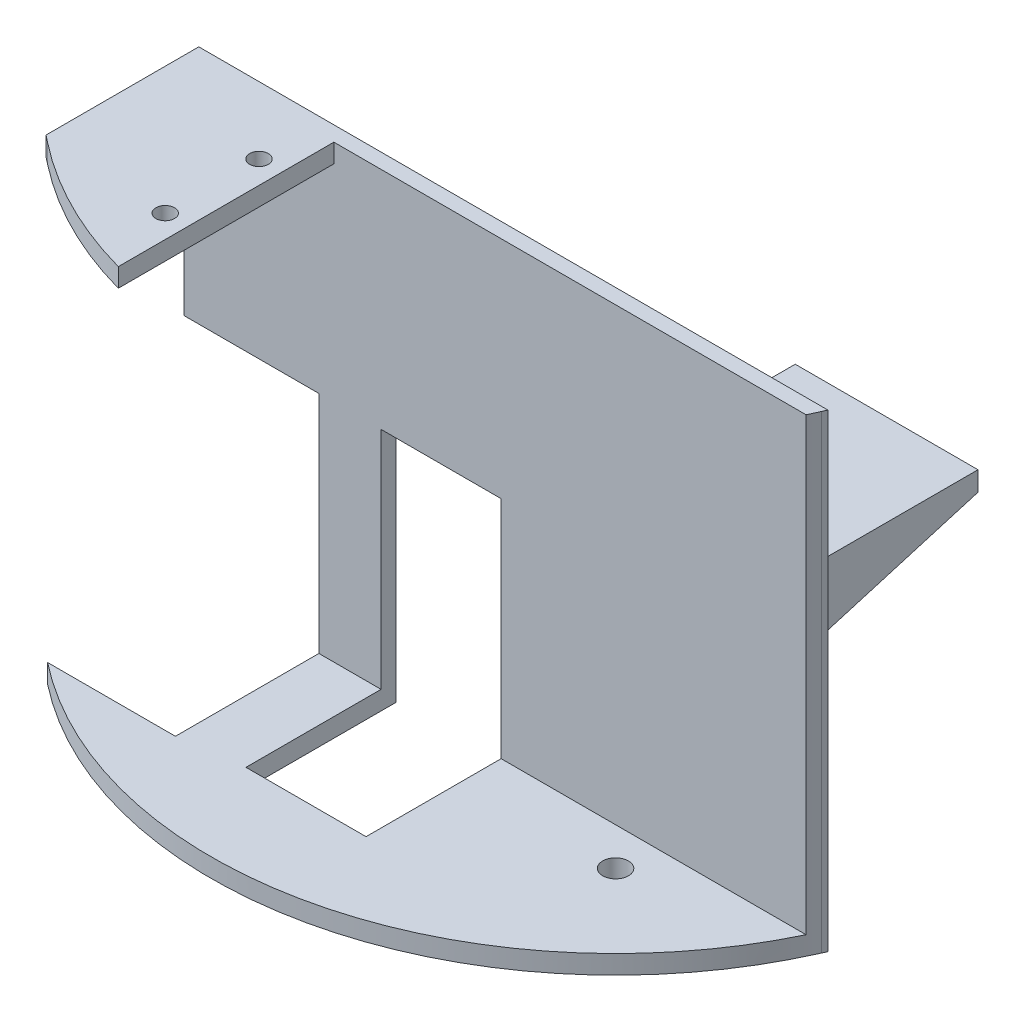
ISO-10303-21;
HEADER;
FILE_DESCRIPTION(('STEP AP214'),'2;1');
FILE_NAME('part.step','',(''),(''),'','','');
FILE_SCHEMA(('AUTOMOTIVE_DESIGN { 1 0 10303 214 1 1 1 1 }'));
ENDSEC;
DATA;
#1=APPLICATION_CONTEXT('core data for automotive mechanical design processes');
#2=APPLICATION_PROTOCOL_DEFINITION('international standard','automotive_design',2000,#1);
#3=PRODUCT_CONTEXT('',#1,'mechanical');
#4=PRODUCT('Part','Part','',(#3));
#5=PRODUCT_RELATED_PRODUCT_CATEGORY('part','',(#4));
#6=PRODUCT_DEFINITION_FORMATION('','',#4);
#7=PRODUCT_DEFINITION_CONTEXT('part definition',#1,'design');
#8=PRODUCT_DEFINITION('design','',#6,#7);
#9=PRODUCT_DEFINITION_SHAPE('','',#8);
#10=(LENGTH_UNIT() NAMED_UNIT(*) SI_UNIT(.MILLI.,.METRE.));
#11=(NAMED_UNIT(*) PLANE_ANGLE_UNIT() SI_UNIT($,.RADIAN.));
#12=(NAMED_UNIT(*) SI_UNIT($,.STERADIAN.) SOLID_ANGLE_UNIT());
#13=UNCERTAINTY_MEASURE_WITH_UNIT(LENGTH_MEASURE(1.E-05),#10,'distance_accuracy_value','');
#14=(GEOMETRIC_REPRESENTATION_CONTEXT(3) GLOBAL_UNCERTAINTY_ASSIGNED_CONTEXT((#13)) GLOBAL_UNIT_ASSIGNED_CONTEXT((#10,
#11,#12)) REPRESENTATION_CONTEXT('',''));
#15=CARTESIAN_POINT('',(0.,0.,0.));
#16=DIRECTION('',(0.,0.,1.));
#17=DIRECTION('',(1.,0.,0.));
#18=AXIS2_PLACEMENT_3D('',#15,#16,#17);
#19=CARTESIAN_POINT('',(-32.6114435653735,7.9375,-8.93386896524965));
#20=DIRECTION('',(0.,0.,1.));
#21=DIRECTION('',(1.,0.,0.));
#22=AXIS2_PLACEMENT_3D('',#19,#20,#21);
#23=PLANE('',#22);
#24=DIRECTION('',(0.,1.,0.));
#25=VECTOR('',#24,1.);
#26=CARTESIAN_POINT('',(73.8433277014909,4.76249999999823,-8.93386896524965));
#27=LINE('',#26,#25);
#28=CARTESIAN_POINT('',(73.8433277014909,4.76249999999823,-8.93386896524965));
#29=VERTEX_POINT('',#28);
#30=CARTESIAN_POINT('',(73.8433277014909,51.8903634093588,-8.93386896524965));
#31=VERTEX_POINT('',#30);
#32=EDGE_CURVE('E237',#29,#31,#27,.T.);
#33=ORIENTED_EDGE('',*,*,#32,.F.);
#34=DIRECTION('',(-1.,0.,0.));
#35=VECTOR('',#34,1.);
#36=CARTESIAN_POINT('',(-32.6114435653735,4.7625,-8.93386896524965));
#37=LINE('',#36,#35);
#38=CARTESIAN_POINT('',(21.0892364346265,4.7625,-8.93386896524965));
#39=VERTEX_POINT('',#38);
#40=EDGE_CURVE('E369',#29,#39,#37,.T.);
#41=ORIENTED_EDGE('',*,*,#40,.T.);
#42=DIRECTION('',(0.,1.,0.));
#43=VECTOR('',#42,1.);
#44=CARTESIAN_POINT('',(21.0892364346265,7.9375,-8.93386896524965));
#45=LINE('',#44,#43);
#46=CARTESIAN_POINT('',(21.0892364346265,46.0375,-8.93386896524965));
#47=VERTEX_POINT('',#46);
#48=EDGE_CURVE('E267',#39,#47,#45,.T.);
#49=ORIENTED_EDGE('',*,*,#48,.T.);
#50=DIRECTION('',(-1.,0.,0.));
#51=VECTOR('',#50,1.);
#52=CARTESIAN_POINT('',(0.769236434626468,46.0375,-8.93386896524965));
#53=LINE('',#52,#51);
#54=CARTESIAN_POINT('',(0.769236434626468,46.0375,-8.93386896524965));
#55=VERTEX_POINT('',#54);
#56=EDGE_CURVE('E271',#47,#55,#53,.T.);
#57=ORIENTED_EDGE('',*,*,#56,.T.);
#58=DIRECTION('',(0.,-1.,0.));
#59=VECTOR('',#58,1.);
#60=CARTESIAN_POINT('',(0.769236434626466,7.9375,-8.93386896524965));
#61=LINE('',#60,#59);
#62=CARTESIAN_POINT('',(0.769236434626468,4.7625,-8.93386896524965));
#63=VERTEX_POINT('',#62);
#64=EDGE_CURVE('E265',#55,#63,#61,.T.);
#65=ORIENTED_EDGE('',*,*,#64,.T.);
#66=CARTESIAN_POINT('',(-9.75144356537351,4.76249999999823,-8.93386896524965));
#67=VERTEX_POINT('',#66);
#68=EDGE_CURVE('E368',#63,#67,#37,.T.);
#69=ORIENTED_EDGE('',*,*,#68,.T.);
#70=DIRECTION('',(0.,1.,0.));
#71=VECTOR('',#70,1.);
#72=CARTESIAN_POINT('',(-9.75144356537351,7.9375,-8.93386896524965));
#73=LINE('',#72,#71);
#74=CARTESIAN_POINT('',(-9.75144356537351,46.0375,-8.93386896524965));
#75=VERTEX_POINT('',#74);
#76=EDGE_CURVE('E296',#67,#75,#73,.T.);
#77=ORIENTED_EDGE('',*,*,#76,.T.);
#78=DIRECTION('',(-1.,0.,0.));
#79=VECTOR('',#78,1.);
#80=CARTESIAN_POINT('',(-32.6114435653735,46.0375,-8.93386896524965));
#81=LINE('',#80,#79);
#82=CARTESIAN_POINT('',(-32.6114435653735,46.0375,-8.93386896524965));
#83=VERTEX_POINT('',#82);
#84=EDGE_CURVE('E299',#75,#83,#81,.T.);
#85=ORIENTED_EDGE('',*,*,#84,.T.);
#86=DIRECTION('',(0.,-1.,0.));
#87=VECTOR('',#86,1.);
#88=CARTESIAN_POINT('',(-32.6114435653735,7.9375,-8.93386896524965));
#89=LINE('',#88,#87);
#90=CARTESIAN_POINT('',(-32.6114435653735,84.1375,-8.93386896524965));
#91=VERTEX_POINT('',#90);
#92=EDGE_CURVE('E371',#91,#83,#89,.T.);
#93=ORIENTED_EDGE('',*,*,#92,.F.);
#94=DIRECTION('',(-1.,0.,0.));
#95=VECTOR('',#94,1.);
#96=CARTESIAN_POINT('',(0.,84.1375,-8.93386896524965));
#97=LINE('',#96,#95);
#98=CARTESIAN_POINT('',(73.8433277014909,84.1375,-8.93386896524965));
#99=VERTEX_POINT('',#98);
#100=EDGE_CURVE('E357',#99,#91,#97,.T.);
#101=ORIENTED_EDGE('',*,*,#100,.F.);
#102=CARTESIAN_POINT('',(73.8433277014909,62.6889376582972,-8.93386896524965));
#103=VERTEX_POINT('',#102);
#104=EDGE_CURVE('E240',#103,#99,#27,.T.);
#105=ORIENTED_EDGE('',*,*,#104,.F.);
#106=DIRECTION('',(1.,0.,0.));
#107=VECTOR('',#106,1.);
#108=CARTESIAN_POINT('',(74.6661258217781,62.6889376582972,-8.93386896524965));
#109=LINE('',#108,#107);
#110=CARTESIAN_POINT('',(42.9161258217781,62.6889376582972,-8.93386896524965));
#111=VERTEX_POINT('',#110);
#112=EDGE_CURVE('E342',#111,#103,#109,.T.);
#113=ORIENTED_EDGE('',*,*,#112,.F.);
#114=DIRECTION('',(0.,1.,0.));
#115=VECTOR('',#114,1.);
#116=CARTESIAN_POINT('',(42.9161258217781,62.6889376582972,-8.93386896524965));
#117=LINE('',#116,#115);
#118=CARTESIAN_POINT('',(42.9161258217781,51.8903634093588,-8.93386896524965));
#119=VERTEX_POINT('',#118);
#120=EDGE_CURVE('E338',#119,#111,#117,.T.);
#121=ORIENTED_EDGE('',*,*,#120,.F.);
#122=DIRECTION('',(-1.,0.,0.));
#123=VECTOR('',#122,1.);
#124=CARTESIAN_POINT('',(74.6661258217781,51.8903634093588,-8.93386896524965));
#125=LINE('',#124,#123);
#126=EDGE_CURVE('E336',#31,#119,#125,.T.);
#127=ORIENTED_EDGE('',*,*,#126,.F.);
#128=EDGE_LOOP('',(#33,#41,#49,#57,#65,#69,#77,#85,#93,#101,#105,#113,#121,#127));
#129=FACE_BOUND('',#128,.T.);
#130=ADVANCED_FACE('F39',(#129),#23,.F.);
#131=CARTESIAN_POINT('',(10.9292364346265,7.9375,-35.9213689652496));
#132=DIRECTION('',(0.,1.,0.));
#133=DIRECTION('',(0.,0.,1.));
#134=AXIS2_PLACEMENT_3D('',#131,#132,#133);
#135=PLANE('',#134);
#136=CARTESIAN_POINT('',(46.8499164346265,7.9375,0.));
#137=DIRECTION('',(0.,1.,0.));
#138=DIRECTION('',(0.,0.,1.));
#139=AXIS2_PLACEMENT_3D('',#136,#137,#138);
#140=CIRCLE('',#139,2.182495);
#141=CARTESIAN_POINT('',(46.8499164346265,7.9375,2.182495));
#142=VERTEX_POINT('',#141);
#143=EDGE_CURVE('E365',#142,#142,#140,.T.);
#144=ORIENTED_EDGE('',*,*,#143,.F.);
#145=EDGE_LOOP('',(#144));
#146=FACE_BOUND('',#145,.T.);
#147=DIRECTION('',(1.,0.,0.));
#148=VECTOR('',#147,1.);
#149=CARTESIAN_POINT('',(-32.6114435653735,7.9375,17.8831420922593));
#150=LINE('',#149,#148);
#151=CARTESIAN_POINT('',(-31.3896458623151,7.9375,17.8831420922593));
#152=VERTEX_POINT('',#151);
#153=CARTESIAN_POINT('',(-9.75144356537351,7.9375,17.8831420922593));
#154=VERTEX_POINT('',#153);
#155=EDGE_CURVE('E284',#152,#154,#150,.T.);
#156=ORIENTED_EDGE('',*,*,#155,.F.);
#157=CARTESIAN_POINT('',(10.9292364346265,7.9375,-35.9213689652497));
#158=DIRECTION('',(0.,1.,0.));
#159=DIRECTION('',(0.,0.,1.));
#160=AXIS2_PLACEMENT_3D('',#157,#158,#159);
#161=CIRCLE('',#160,68.453);
#162=CARTESIAN_POINT('',(72.6863409065008,7.9375,-6.39386896524965));
#163=VERTEX_POINT('',#162);
#164=EDGE_CURVE('E53',#152,#163,#161,.T.);
#165=ORIENTED_EDGE('',*,*,#164,.T.);
#166=DIRECTION('',(-1.,0.,0.));
#167=VECTOR('',#166,1.);
#168=CARTESIAN_POINT('',(0.,7.9375,-6.39386896524965));
#169=LINE('',#168,#167);
#170=CARTESIAN_POINT('',(21.0892364346265,7.9375,-6.39386896524965));
#171=VERTEX_POINT('',#170);
#172=EDGE_CURVE('E358',#163,#171,#169,.T.);
#173=ORIENTED_EDGE('',*,*,#172,.T.);
#174=DIRECTION('',(0.,0.,-1.));
#175=VECTOR('',#174,1.);
#176=CARTESIAN_POINT('',(21.0892364346265,7.9375,-8.93386896524965));
#177=LINE('',#176,#175);
#178=CARTESIAN_POINT('',(21.0892364346265,7.9375,16.4661310347504));
#179=VERTEX_POINT('',#178);
#180=EDGE_CURVE('E257',#179,#171,#177,.T.);
#181=ORIENTED_EDGE('',*,*,#180,.F.);
#182=DIRECTION('',(1.,0.,0.));
#183=VECTOR('',#182,1.);
#184=CARTESIAN_POINT('',(0.769236434626471,7.9375,16.4661310347504));
#185=LINE('',#184,#183);
#186=CARTESIAN_POINT('',(0.769236434626471,7.9375,16.4661310347504));
#187=VERTEX_POINT('',#186);
#188=EDGE_CURVE('E254',#187,#179,#185,.T.);
#189=ORIENTED_EDGE('',*,*,#188,.F.);
#190=DIRECTION('',(0.,0.,1.));
#191=VECTOR('',#190,1.);
#192=CARTESIAN_POINT('',(0.769236434626468,7.9375,-8.93386896524965));
#193=LINE('',#192,#191);
#194=CARTESIAN_POINT('',(0.769236434626468,7.9375,-6.39386896524965));
#195=VERTEX_POINT('',#194);
#196=EDGE_CURVE('E251',#195,#187,#193,.T.);
#197=ORIENTED_EDGE('',*,*,#196,.F.);
#198=CARTESIAN_POINT('',(-9.75144356537351,7.9375,-6.39386896524965));
#199=VERTEX_POINT('',#198);
#200=EDGE_CURVE('E354',#195,#199,#169,.T.);
#201=ORIENTED_EDGE('',*,*,#200,.T.);
#202=DIRECTION('',(0.,0.,-1.));
#203=VECTOR('',#202,1.);
#204=CARTESIAN_POINT('',(-9.75144356537351,7.9375,-8.93386896524965));
#205=LINE('',#204,#203);
#206=EDGE_CURVE('E287',#154,#199,#205,.T.);
#207=ORIENTED_EDGE('',*,*,#206,.F.);
#208=EDGE_LOOP('',(#156,#165,#173,#181,#189,#197,#201,#207));
#209=FACE_BOUND('',#208,.T.);
#210=ADVANCED_FACE('F396',(#146,#209),#135,.T.);
#211=CARTESIAN_POINT('',(10.9292364346265,4.7625,-35.9213689652496));
#212=DIRECTION('',(0.,1.,0.));
#213=DIRECTION('',(0.,0.,1.));
#214=AXIS2_PLACEMENT_3D('',#211,#212,#213);
#215=PLANE('',#214);
#216=CARTESIAN_POINT('',(46.8499164346265,4.7625,0.));
#217=DIRECTION('',(0.,-1.,0.));
#218=DIRECTION('',(0.,0.,-1.));
#219=AXIS2_PLACEMENT_3D('',#216,#217,#218);
#220=CIRCLE('',#219,2.182495);
#221=CARTESIAN_POINT('',(46.8499164346265,4.7625,-2.182495));
#222=VERTEX_POINT('',#221);
#223=EDGE_CURVE('E248',#222,#222,#220,.T.);
#224=ORIENTED_EDGE('',*,*,#223,.F.);
#225=EDGE_LOOP('',(#224));
#226=FACE_BOUND('',#225,.T.);
#227=CARTESIAN_POINT('',(10.9292364346265,4.76249999999823,-35.9213689652497));
#228=DIRECTION('',(0.,1.,0.));
#229=DIRECTION('',(0.,0.,1.));
#230=AXIS2_PLACEMENT_3D('',#227,#228,#229);
#231=CIRCLE('',#230,68.453);
#232=CARTESIAN_POINT('',(-31.3896458623151,4.76249999999823,17.8831420922593));
#233=VERTEX_POINT('',#232);
#234=CARTESIAN_POINT('',(73.5054176759742,4.76249999999823,-8.17186896524965));
#235=VERTEX_POINT('',#234);
#236=EDGE_CURVE('E225',#233,#235,#231,.T.);
#237=ORIENTED_EDGE('',*,*,#236,.F.);
#238=DIRECTION('',(1.,0.,0.));
#239=VECTOR('',#238,1.);
#240=CARTESIAN_POINT('',(10.9292364346265,4.7625,17.8831420922593));
#241=LINE('',#240,#239);
#242=CARTESIAN_POINT('',(-9.75144356537351,4.76249999999823,17.8831420922593));
#243=VERTEX_POINT('',#242);
#244=EDGE_CURVE('E293',#233,#243,#241,.T.);
#245=ORIENTED_EDGE('',*,*,#244,.T.);
#246=DIRECTION('',(0.,0.,-1.));
#247=VECTOR('',#246,1.);
#248=CARTESIAN_POINT('',(-9.75144356537352,4.7625,-35.9213689652496));
#249=LINE('',#248,#247);
#250=EDGE_CURVE('E374',#243,#67,#249,.T.);
#251=ORIENTED_EDGE('',*,*,#250,.T.);
#252=ORIENTED_EDGE('',*,*,#68,.F.);
#253=DIRECTION('',(0.,0.,1.));
#254=VECTOR('',#253,1.);
#255=CARTESIAN_POINT('',(0.769236434626465,4.7625,-35.9213689652496));
#256=LINE('',#255,#254);
#257=CARTESIAN_POINT('',(0.769236434626471,4.7625,16.4661310347504));
#258=VERTEX_POINT('',#257);
#259=EDGE_CURVE('E11',#63,#258,#256,.T.);
#260=ORIENTED_EDGE('',*,*,#259,.T.);
#261=DIRECTION('',(1.,0.,0.));
#262=VECTOR('',#261,1.);
#263=CARTESIAN_POINT('',(10.9292364346265,4.7625,16.4661310347504));
#264=LINE('',#263,#262);
#265=CARTESIAN_POINT('',(21.0892364346265,4.7625,16.4661310347504));
#266=VERTEX_POINT('',#265);
#267=EDGE_CURVE('E377',#258,#266,#264,.T.);
#268=ORIENTED_EDGE('',*,*,#267,.T.);
#269=DIRECTION('',(0.,0.,-1.));
#270=VECTOR('',#269,1.);
#271=CARTESIAN_POINT('',(21.0892364346265,4.7625,-35.9213689652496));
#272=LINE('',#271,#270);
#273=EDGE_CURVE('E46',#266,#39,#272,.T.);
#274=ORIENTED_EDGE('',*,*,#273,.T.);
#275=ORIENTED_EDGE('',*,*,#40,.F.);
#276=DIRECTION('',(0.405380333951755,0.,-0.914148119751478));
#277=VECTOR('',#276,1.);
#278=CARTESIAN_POINT('',(58.3977238967535,4.76249999999823,25.8965569187236));
#279=LINE('',#278,#277);
#280=EDGE_CURVE('E205',#235,#29,#279,.T.);
#281=ORIENTED_EDGE('',*,*,#280,.F.);
#282=EDGE_LOOP('',(#237,#245,#251,#252,#260,#268,#274,#275,#281));
#283=FACE_BOUND('',#282,.T.);
#284=ADVANCED_FACE('F383',(#226,#283),#215,.F.);
#285=CARTESIAN_POINT('',(0.,84.1375,-6.39386896524965));
#286=DIRECTION('',(0.,0.,1.));
#287=DIRECTION('',(1.,0.,0.));
#288=AXIS2_PLACEMENT_3D('',#285,#286,#287);
#289=PLANE('',#288);
#290=ORIENTED_EDGE('',*,*,#172,.F.);
#291=DIRECTION('',(0.,1.,0.));
#292=VECTOR('',#291,1.);
#293=CARTESIAN_POINT('',(72.6863409065008,4.76249999999823,-6.39386896524965));
#294=LINE('',#293,#292);
#295=CARTESIAN_POINT('',(72.6863409065008,84.1375,-6.39386896524964));
#296=VERTEX_POINT('',#295);
#297=EDGE_CURVE('E244',#163,#296,#294,.T.);
#298=ORIENTED_EDGE('',*,*,#297,.T.);
#299=DIRECTION('',(-1.,0.,0.));
#300=VECTOR('',#299,1.);
#301=CARTESIAN_POINT('',(0.,84.1375,-6.39386896524965));
#302=LINE('',#301,#300);
#303=CARTESIAN_POINT('',(-7.21144356537354,84.1375,-6.39386896524965));
#304=VERTEX_POINT('',#303);
#305=EDGE_CURVE('E355',#296,#304,#302,.T.);
#306=ORIENTED_EDGE('',*,*,#305,.T.);
#307=DIRECTION('',(0.,1.,0.));
#308=VECTOR('',#307,1.);
#309=CARTESIAN_POINT('',(-7.21144356537354,80.9625,-6.39386896524965));
#310=LINE('',#309,#308);
#311=CARTESIAN_POINT('',(-7.21144356537354,80.9625,-6.39386896524965));
#312=VERTEX_POINT('',#311);
#313=EDGE_CURVE('E330',#312,#304,#310,.T.);
#314=ORIENTED_EDGE('',*,*,#313,.F.);
#315=DIRECTION('',(-1.,0.,0.));
#316=VECTOR('',#315,1.);
#317=CARTESIAN_POINT('',(-32.6114435653735,80.9625,-6.39386896524965));
#318=LINE('',#317,#316);
#319=CARTESIAN_POINT('',(-32.6114435653735,80.9625,-6.39386896524965));
#320=VERTEX_POINT('',#319);
#321=EDGE_CURVE('E324',#312,#320,#318,.T.);
#322=ORIENTED_EDGE('',*,*,#321,.T.);
#323=DIRECTION('',(0.,-1.,0.));
#324=VECTOR('',#323,1.);
#325=CARTESIAN_POINT('',(-32.6114435653735,84.1375,-6.39386896524965));
#326=LINE('',#325,#324);
#327=CARTESIAN_POINT('',(-32.6114435653735,46.0375,-6.39386896524965));
#328=VERTEX_POINT('',#327);
#329=EDGE_CURVE('E361',#320,#328,#326,.T.);
#330=ORIENTED_EDGE('',*,*,#329,.T.);
#331=DIRECTION('',(-1.,0.,0.));
#332=VECTOR('',#331,1.);
#333=CARTESIAN_POINT('',(-32.6114435653735,46.0375,-6.39386896524965));
#334=LINE('',#333,#332);
#335=CARTESIAN_POINT('',(-9.75144356537351,46.0375,-6.39386896524965));
#336=VERTEX_POINT('',#335);
#337=EDGE_CURVE('E300',#336,#328,#334,.T.);
#338=ORIENTED_EDGE('',*,*,#337,.F.);
#339=DIRECTION('',(0.,1.,0.));
#340=VECTOR('',#339,1.);
#341=CARTESIAN_POINT('',(-9.75144356537351,7.9375,-6.39386896524965));
#342=LINE('',#341,#340);
#343=EDGE_CURVE('E295',#199,#336,#342,.T.);
#344=ORIENTED_EDGE('',*,*,#343,.F.);
#345=ORIENTED_EDGE('',*,*,#200,.F.);
#346=DIRECTION('',(0.,-1.,0.));
#347=VECTOR('',#346,1.);
#348=CARTESIAN_POINT('',(0.769236434626466,7.9375,-6.39386896524965));
#349=LINE('',#348,#347);
#350=CARTESIAN_POINT('',(0.769236434626468,46.0375,-6.39386896524965));
#351=VERTEX_POINT('',#350);
#352=EDGE_CURVE('E263',#351,#195,#349,.T.);
#353=ORIENTED_EDGE('',*,*,#352,.F.);
#354=DIRECTION('',(-1.,0.,0.));
#355=VECTOR('',#354,1.);
#356=CARTESIAN_POINT('',(0.769236434626468,46.0375,-6.39386896524965));
#357=LINE('',#356,#355);
#358=CARTESIAN_POINT('',(21.0892364346265,46.0375,-6.39386896524965));
#359=VERTEX_POINT('',#358);
#360=EDGE_CURVE('E268',#359,#351,#357,.T.);
#361=ORIENTED_EDGE('',*,*,#360,.F.);
#362=DIRECTION('',(0.,1.,0.));
#363=VECTOR('',#362,1.);
#364=CARTESIAN_POINT('',(21.0892364346265,7.9375,-6.39386896524965));
#365=LINE('',#364,#363);
#366=EDGE_CURVE('E277',#171,#359,#365,.T.);
#367=ORIENTED_EDGE('',*,*,#366,.F.);
#368=EDGE_LOOP('',(#290,#298,#306,#314,#322,#330,#338,#344,#345,#353,#361,#367));
#369=FACE_BOUND('',#368,.T.);
#370=ADVANCED_FACE('F401',(#369),#289,.T.);
#371=CARTESIAN_POINT('',(0.,84.1375,0.));
#372=DIRECTION('',(0.,1.,0.));
#373=DIRECTION('',(0.,0.,1.));
#374=AXIS2_PLACEMENT_3D('',#371,#372,#373);
#375=PLANE('',#374);
#376=DIRECTION('',(-0.786006618519408,0.,-0.618218080974413));
#377=VECTOR('',#376,1.);
#378=CARTESIAN_POINT('',(-20.6867606741951,84.1375,26.3012864004496));
#379=LINE('',#378,#377);
#380=CARTESIAN_POINT('',(-31.3896458623152,84.1375,17.8831420922593));
#381=VERTEX_POINT('',#380);
#382=CARTESIAN_POINT('',(-32.6114435653735,84.1375,16.9221610858315));
#383=VERTEX_POINT('',#382);
#384=EDGE_CURVE('E197',#381,#383,#379,.T.);
#385=ORIENTED_EDGE('',*,*,#384,.F.);
#386=CARTESIAN_POINT('',(10.9292364346265,84.1375,-35.9213689652497));
#387=DIRECTION('',(0.,1.,0.));
#388=DIRECTION('',(0.,0.,1.));
#389=AXIS2_PLACEMENT_3D('',#386,#387,#388);
#390=CIRCLE('',#389,68.453);
#391=CARTESIAN_POINT('',(-7.21144356537353,84.1375,30.0841530623626));
#392=VERTEX_POINT('',#391);
#393=EDGE_CURVE('E213',#381,#392,#390,.T.);
#394=ORIENTED_EDGE('',*,*,#393,.T.);
#395=DIRECTION('',(0.,0.,-1.));
#396=VECTOR('',#395,1.);
#397=CARTESIAN_POINT('',(-7.21144356537354,84.1375,-6.39386896524965));
#398=LINE('',#397,#396);
#399=EDGE_CURVE('E315',#392,#304,#398,.T.);
#400=ORIENTED_EDGE('',*,*,#399,.T.);
#401=ORIENTED_EDGE('',*,*,#305,.F.);
#402=CARTESIAN_POINT('',(73.5054176759742,84.1375,-8.17186896524965));
#403=VERTEX_POINT('',#402);
#404=EDGE_CURVE('E222',#296,#403,#390,.T.);
#405=ORIENTED_EDGE('',*,*,#404,.T.);
#406=DIRECTION('',(0.405380333951755,0.,-0.914148119751478));
#407=VECTOR('',#406,1.);
#408=CARTESIAN_POINT('',(58.3977238967535,84.1375,25.8965569187236));
#409=LINE('',#408,#407);
#410=EDGE_CURVE('E221',#403,#99,#409,.T.);
#411=ORIENTED_EDGE('',*,*,#410,.T.);
#412=ORIENTED_EDGE('',*,*,#100,.T.);
#413=DIRECTION('',(0.,0.,1.));
#414=VECTOR('',#413,1.);
#415=CARTESIAN_POINT('',(-32.6114435653735,84.1375,0.));
#416=LINE('',#415,#414);
#417=EDGE_CURVE('E216',#91,#383,#416,.T.);
#418=ORIENTED_EDGE('',*,*,#417,.T.);
#419=EDGE_LOOP('',(#385,#394,#400,#401,#405,#411,#412,#418));
#420=FACE_BOUND('',#419,.T.);
#421=CARTESIAN_POINT('',(-11.0817917280213,84.1375,2.40851705671662));
#422=DIRECTION('',(0.,1.,0.));
#423=DIRECTION('',(0.,0.,1.));
#424=AXIS2_PLACEMENT_3D('',#421,#422,#423);
#425=CIRCLE('',#424,1.58590582087397);
#426=CARTESIAN_POINT('',(-11.0817917280213,84.1375,3.99442287759059));
#427=VERTEX_POINT('',#426);
#428=EDGE_CURVE('E316',#427,#427,#425,.T.);
#429=ORIENTED_EDGE('',*,*,#428,.F.);
#430=EDGE_LOOP('',(#429));
#431=FACE_BOUND('',#430,.T.);
#432=CARTESIAN_POINT('',(-11.0817917280213,84.1375,18.2835170567166));
#433=DIRECTION('',(0.,1.,0.));
#434=DIRECTION('',(0.,0.,1.));
#435=AXIS2_PLACEMENT_3D('',#432,#433,#434);
#436=CIRCLE('',#435,1.58590582087397);
#437=CARTESIAN_POINT('',(-11.0817917280213,84.1375,19.8694228775906));
#438=VERTEX_POINT('',#437);
#439=EDGE_CURVE('E319',#438,#438,#436,.T.);
#440=ORIENTED_EDGE('',*,*,#439,.F.);
#441=EDGE_LOOP('',(#440));
#442=FACE_BOUND('',#441,.T.);
#443=ADVANCED_FACE('F210',(#420,#431,#442),#375,.T.);
#444=CARTESIAN_POINT('',(-7.21144356537354,80.9625,-6.39386896524965));
#445=DIRECTION('',(1.,0.,0.));
#446=DIRECTION('',(0.,0.,-1.));
#447=AXIS2_PLACEMENT_3D('',#444,#445,#446);
#448=PLANE('',#447);
#449=ORIENTED_EDGE('',*,*,#399,.F.);
#450=DIRECTION('',(0.,1.,0.));
#451=VECTOR('',#450,1.);
#452=CARTESIAN_POINT('',(-7.21144356537353,4.76249999999823,30.0841530623626));
#453=LINE('',#452,#451);
#454=CARTESIAN_POINT('',(-7.21144356537353,80.9625,30.0841530623626));
#455=VERTEX_POINT('',#454);
#456=EDGE_CURVE('E220',#392,#455,#453,.F.);
#457=ORIENTED_EDGE('',*,*,#456,.T.);
#458=DIRECTION('',(0.,0.,-1.));
#459=VECTOR('',#458,1.);
#460=CARTESIAN_POINT('',(-7.21144356537354,80.9625,-6.39386896524965));
#461=LINE('',#460,#459);
#462=EDGE_CURVE('E61',#455,#312,#461,.T.);
#463=ORIENTED_EDGE('',*,*,#462,.T.);
#464=ORIENTED_EDGE('',*,*,#313,.T.);
#465=EDGE_LOOP('',(#449,#457,#463,#464));
#466=FACE_BOUND('',#465,.T.);
#467=ADVANCED_FACE('F502',(#466),#448,.T.);
#468=CARTESIAN_POINT('',(10.9292364346265,80.9625,-35.9213689652496));
#469=DIRECTION('',(0.,1.,0.));
#470=DIRECTION('',(0.,0.,1.));
#471=AXIS2_PLACEMENT_3D('',#468,#469,#470);
#472=PLANE('',#471);
#473=CARTESIAN_POINT('',(-11.0817917280213,80.9625,18.2835170567166));
#474=DIRECTION('',(0.,1.,0.));
#475=DIRECTION('',(0.,0.,1.));
#476=AXIS2_PLACEMENT_3D('',#473,#474,#475);
#477=CIRCLE('',#476,1.58590582087397);
#478=CARTESIAN_POINT('',(-11.0817917280213,80.9625,19.8694228775906));
#479=VERTEX_POINT('',#478);
#480=EDGE_CURVE('E310',#479,#479,#477,.T.);
#481=ORIENTED_EDGE('',*,*,#480,.T.);
#482=EDGE_LOOP('',(#481));
#483=FACE_BOUND('',#482,.T.);
#484=CARTESIAN_POINT('',(-11.0817917280213,80.9625,2.40851705671662));
#485=DIRECTION('',(0.,1.,0.));
#486=DIRECTION('',(0.,0.,1.));
#487=AXIS2_PLACEMENT_3D('',#484,#485,#486);
#488=CIRCLE('',#487,1.58590582087397);
#489=CARTESIAN_POINT('',(-11.0817917280213,80.9625,3.99442287759059));
#490=VERTEX_POINT('',#489);
#491=EDGE_CURVE('E312',#490,#490,#488,.T.);
#492=ORIENTED_EDGE('',*,*,#491,.T.);
#493=EDGE_LOOP('',(#492));
#494=FACE_BOUND('',#493,.T.);
#495=CARTESIAN_POINT('',(10.9292364346265,80.9625,-35.9213689652497));
#496=DIRECTION('',(0.,1.,0.));
#497=DIRECTION('',(0.,0.,1.));
#498=AXIS2_PLACEMENT_3D('',#495,#496,#497);
#499=CIRCLE('',#498,68.453);
#500=CARTESIAN_POINT('',(-31.3896458623151,80.9625,17.8831420922593));
#501=VERTEX_POINT('',#500);
#502=EDGE_CURVE('E236',#501,#455,#499,.T.);
#503=ORIENTED_EDGE('',*,*,#502,.F.);
#504=DIRECTION('',(-0.786006618519408,0.,-0.618218080974413));
#505=VECTOR('',#504,1.);
#506=CARTESIAN_POINT('',(-31.389645862315,80.9625,17.8831420922594));
#507=LINE('',#506,#505);
#508=CARTESIAN_POINT('',(-32.6114435653735,80.9625,16.9221610858315));
#509=VERTEX_POINT('',#508);
#510=EDGE_CURVE('E200',#501,#509,#507,.T.);
#511=ORIENTED_EDGE('',*,*,#510,.T.);
#512=DIRECTION('',(0.,0.,1.));
#513=VECTOR('',#512,1.);
#514=CARTESIAN_POINT('',(-32.6114435653735,80.9625,-6.39386896524965));
#515=LINE('',#514,#513);
#516=EDGE_CURVE('E326',#320,#509,#515,.T.);
#517=ORIENTED_EDGE('',*,*,#516,.F.);
#518=ORIENTED_EDGE('',*,*,#321,.F.);
#519=ORIENTED_EDGE('',*,*,#462,.F.);
#520=EDGE_LOOP('',(#503,#511,#517,#518,#519));
#521=FACE_BOUND('',#520,.T.);
#522=ADVANCED_FACE('F478',(#483,#494,#521),#472,.F.);
#523=CARTESIAN_POINT('',(-32.6114435653735,-5072.0625,17.8831420922593));
#524=DIRECTION('',(0.,0.,1.));
#525=DIRECTION('',(1.,0.,0.));
#526=AXIS2_PLACEMENT_3D('',#523,#524,#525);
#527=PLANE('',#526);
#528=DIRECTION('',(0.,1.,0.));
#529=VECTOR('',#528,1.);
#530=CARTESIAN_POINT('',(-31.3896458623151,4.76249999999823,17.8831420922593));
#531=LINE('',#530,#529);
#532=EDGE_CURVE('E204',#233,#152,#531,.T.);
#533=ORIENTED_EDGE('',*,*,#532,.T.);
#534=ORIENTED_EDGE('',*,*,#155,.T.);
#535=DIRECTION('',(0.,1.,0.));
#536=VECTOR('',#535,1.);
#537=CARTESIAN_POINT('',(-9.75144356537351,-5072.0625,17.8831420922593));
#538=LINE('',#537,#536);
#539=EDGE_CURVE('E290',#243,#154,#538,.T.);
#540=ORIENTED_EDGE('',*,*,#539,.F.);
#541=ORIENTED_EDGE('',*,*,#244,.F.);
#542=EDGE_LOOP('',(#533,#534,#540,#541));
#543=FACE_BOUND('',#542,.T.);
#544=ADVANCED_FACE('F422',(#543),#527,.F.);
#545=CARTESIAN_POINT('',(46.8499164346265,7.9375,0.));
#546=DIRECTION('',(0.,-1.,0.));
#547=DIRECTION('',(0.,0.,-1.));
#548=AXIS2_PLACEMENT_3D('',#545,#546,#547);
#549=CYLINDRICAL_SURFACE('',#548,2.182495);
#550=ORIENTED_EDGE('',*,*,#143,.T.);
#551=EDGE_LOOP('',(#550));
#552=FACE_BOUND('',#551,.T.);
#553=ORIENTED_EDGE('',*,*,#223,.T.);
#554=EDGE_LOOP('',(#553));
#555=FACE_BOUND('',#554,.T.);
#556=ADVANCED_FACE('F460',(#552,#555),#549,.F.);
#557=CARTESIAN_POINT('',(-32.6114435653735,7.9375,-8.93386896524965));
#558=DIRECTION('',(1.,0.,0.));
#559=DIRECTION('',(0.,0.,-1.));
#560=AXIS2_PLACEMENT_3D('',#557,#558,#559);
#561=PLANE('',#560);
#562=ORIENTED_EDGE('',*,*,#516,.T.);
#563=DIRECTION('',(0.,1.,0.));
#564=VECTOR('',#563,1.);
#565=CARTESIAN_POINT('',(-32.6114435653735,4.76249999999823,16.9221610858315));
#566=LINE('',#565,#564);
#567=EDGE_CURVE('E217',#509,#383,#566,.T.);
#568=ORIENTED_EDGE('',*,*,#567,.T.);
#569=ORIENTED_EDGE('',*,*,#417,.F.);
#570=ORIENTED_EDGE('',*,*,#92,.T.);
#571=DIRECTION('',(0.,0.,1.));
#572=VECTOR('',#571,1.);
#573=CARTESIAN_POINT('',(-32.6114435653735,46.0375,-8.93386896524965));
#574=LINE('',#573,#572);
#575=EDGE_CURVE('E307',#83,#328,#574,.T.);
#576=ORIENTED_EDGE('',*,*,#575,.T.);
#577=ORIENTED_EDGE('',*,*,#329,.F.);
#578=EDGE_LOOP('',(#562,#568,#569,#570,#576,#577));
#579=FACE_BOUND('',#578,.T.);
#580=ADVANCED_FACE('F462',(#579),#561,.F.);
#581=CARTESIAN_POINT('',(42.9161258217781,62.6889376582972,-34.3338689652496));
#582=DIRECTION('',(1.,0.,0.));
#583=DIRECTION('',(0.,0.,-1.));
#584=AXIS2_PLACEMENT_3D('',#581,#582,#583);
#585=PLANE('',#584);
#586=ORIENTED_EDGE('',*,*,#120,.T.);
#587=DIRECTION('',(0.,0.,1.));
#588=VECTOR('',#587,1.);
#589=CARTESIAN_POINT('',(42.9161258217781,62.6889376582972,-34.3338689652496));
#590=LINE('',#589,#588);
#591=CARTESIAN_POINT('',(42.9161258217781,62.6889376582972,-34.3338689652496));
#592=VERTEX_POINT('',#591);
#593=EDGE_CURVE('E347',#592,#111,#590,.T.);
#594=ORIENTED_EDGE('',*,*,#593,.F.);
#595=DIRECTION('',(0.,1.,0.));
#596=VECTOR('',#595,1.);
#597=CARTESIAN_POINT('',(42.9161258217781,62.6889376582972,-34.3338689652496));
#598=LINE('',#597,#596);
#599=CARTESIAN_POINT('',(42.9161258217781,59.3869376582972,-34.3338689652496));
#600=VERTEX_POINT('',#599);
#601=EDGE_CURVE('E341',#600,#592,#598,.T.);
#602=ORIENTED_EDGE('',*,*,#601,.F.);
#603=DIRECTION('',(0.,-0.283069303011767,0.959099457664549));
#604=VECTOR('',#603,1.);
#605=CARTESIAN_POINT('',(42.9161258217781,59.3869376582972,-34.3338689652496));
#606=LINE('',#605,#604);
#607=EDGE_CURVE('E333',#600,#119,#606,.T.);
#608=ORIENTED_EDGE('',*,*,#607,.T.);
#609=EDGE_LOOP('',(#586,#594,#602,#608));
#610=FACE_BOUND('',#609,.T.);
#611=ADVANCED_FACE('F464',(#610),#585,.F.);
#612=CARTESIAN_POINT('',(74.6661258217781,62.6889376582972,-34.3338689652496));
#613=DIRECTION('',(0.,-1.,0.));
#614=DIRECTION('',(0.,0.,-1.));
#615=AXIS2_PLACEMENT_3D('',#612,#613,#614);
#616=PLANE('',#615);
#617=ORIENTED_EDGE('',*,*,#112,.T.);
#618=DIRECTION('',(0.,0.,1.));
#619=VECTOR('',#618,1.);
#620=CARTESIAN_POINT('',(73.8433277014909,62.6889376582972,-8.93386896524965));
#621=LINE('',#620,#619);
#622=CARTESIAN_POINT('',(73.8433277014909,62.6889376582972,-34.3338689652496));
#623=VERTEX_POINT('',#622);
#624=EDGE_CURVE('E479',#623,#103,#621,.T.);
#625=ORIENTED_EDGE('',*,*,#624,.F.);
#626=DIRECTION('',(1.,0.,0.));
#627=VECTOR('',#626,1.);
#628=CARTESIAN_POINT('',(74.6661258217781,62.6889376582972,-34.3338689652496));
#629=LINE('',#628,#627);
#630=EDGE_CURVE('E344',#592,#623,#629,.T.);
#631=ORIENTED_EDGE('',*,*,#630,.F.);
#632=ORIENTED_EDGE('',*,*,#593,.T.);
#633=EDGE_LOOP('',(#617,#625,#631,#632));
#634=FACE_BOUND('',#633,.T.);
#635=ADVANCED_FACE('F470',(#634),#616,.F.);
#636=CARTESIAN_POINT('',(0.,0.,-34.3338689652496));
#637=DIRECTION('',(0.,0.,1.));
#638=DIRECTION('',(1.,0.,0.));
#639=AXIS2_PLACEMENT_3D('',#636,#637,#638);
#640=PLANE('',#639);
#641=ORIENTED_EDGE('',*,*,#630,.T.);
#642=DIRECTION('',(0.,1.,0.));
#643=VECTOR('',#642,1.);
#644=CARTESIAN_POINT('',(73.8433277014909,4.76249999999823,-34.3338689652496));
#645=LINE('',#644,#643);
#646=CARTESIAN_POINT('',(73.8433277014909,59.3869376582972,-34.3338689652496));
#647=VERTEX_POINT('',#646);
#648=EDGE_CURVE('E481',#647,#623,#645,.T.);
#649=ORIENTED_EDGE('',*,*,#648,.F.);
#650=DIRECTION('',(-1.,0.,0.));
#651=VECTOR('',#650,1.);
#652=CARTESIAN_POINT('',(42.9161258217781,59.3869376582972,-34.3338689652496));
#653=LINE('',#652,#651);
#654=EDGE_CURVE('E339',#647,#600,#653,.T.);
#655=ORIENTED_EDGE('',*,*,#654,.T.);
#656=ORIENTED_EDGE('',*,*,#601,.T.);
#657=EDGE_LOOP('',(#641,#649,#655,#656));
#658=FACE_BOUND('',#657,.T.);
#659=ADVANCED_FACE('F492',(#658),#640,.F.);
#660=CARTESIAN_POINT('',(74.6661258217781,59.3869376582972,-34.3338689652496));
#661=DIRECTION('',(0.,-0.959099457664549,-0.283069303011768));
#662=DIRECTION('',(0.,0.283069303011768,-0.959099457664549));
#663=AXIS2_PLACEMENT_3D('',#660,#661,#662);
#664=PLANE('',#663);
#665=DIRECTION('',(0.,0.283069303011768,-0.959099457664549));
#666=VECTOR('',#665,1.);
#667=CARTESIAN_POINT('',(73.8433277014909,59.3869376582972,-34.3338689652496));
#668=LINE('',#667,#666);
#669=EDGE_CURVE('E228',#31,#647,#668,.T.);
#670=ORIENTED_EDGE('',*,*,#669,.F.);
#671=ORIENTED_EDGE('',*,*,#126,.T.);
#672=ORIENTED_EDGE('',*,*,#607,.F.);
#673=ORIENTED_EDGE('',*,*,#654,.F.);
#674=EDGE_LOOP('',(#670,#671,#672,#673));
#675=FACE_BOUND('',#674,.T.);
#676=ADVANCED_FACE('F495',(#675),#664,.T.);
#677=CARTESIAN_POINT('',(-11.0817917280213,80.9625,18.2835170567166));
#678=DIRECTION('',(0.,1.,0.));
#679=DIRECTION('',(0.,0.,1.));
#680=AXIS2_PLACEMENT_3D('',#677,#678,#679);
#681=CYLINDRICAL_SURFACE('',#680,1.58590582087397);
#682=ORIENTED_EDGE('',*,*,#480,.F.);
#683=EDGE_LOOP('',(#682));
#684=FACE_BOUND('',#683,.T.);
#685=ORIENTED_EDGE('',*,*,#439,.T.);
#686=EDGE_LOOP('',(#685));
#687=FACE_BOUND('',#686,.T.);
#688=ADVANCED_FACE('F516',(#684,#687),#681,.F.);
#689=CARTESIAN_POINT('',(-11.0817917280213,80.9625,2.40851705671662));
#690=DIRECTION('',(0.,1.,0.));
#691=DIRECTION('',(0.,0.,1.));
#692=AXIS2_PLACEMENT_3D('',#689,#690,#691);
#693=CYLINDRICAL_SURFACE('',#692,1.58590582087397);
#694=ORIENTED_EDGE('',*,*,#491,.F.);
#695=EDGE_LOOP('',(#694));
#696=FACE_BOUND('',#695,.T.);
#697=ORIENTED_EDGE('',*,*,#428,.T.);
#698=EDGE_LOOP('',(#697));
#699=FACE_BOUND('',#698,.T.);
#700=ADVANCED_FACE('F715',(#696,#699),#693,.F.);
#701=CARTESIAN_POINT('',(-32.6114435653735,46.0375,-8.93386896524965));
#702=DIRECTION('',(0.,1.,0.));
#703=DIRECTION('',(0.,0.,1.));
#704=AXIS2_PLACEMENT_3D('',#701,#702,#703);
#705=PLANE('',#704);
#706=ORIENTED_EDGE('',*,*,#337,.T.);
#707=ORIENTED_EDGE('',*,*,#575,.F.);
#708=ORIENTED_EDGE('',*,*,#84,.F.);
#709=DIRECTION('',(0.,0.,1.));
#710=VECTOR('',#709,1.);
#711=CARTESIAN_POINT('',(-9.75144356537351,46.0375,-8.93386896524965));
#712=LINE('',#711,#710);
#713=EDGE_CURVE('E303',#75,#336,#712,.T.);
#714=ORIENTED_EDGE('',*,*,#713,.T.);
#715=EDGE_LOOP('',(#706,#707,#708,#714));
#716=FACE_BOUND('',#715,.T.);
#717=ADVANCED_FACE('F431',(#716),#705,.F.);
#718=CARTESIAN_POINT('',(-9.75144356537351,7.9375,-8.93386896524965));
#719=DIRECTION('',(1.,0.,0.));
#720=DIRECTION('',(0.,0.,-1.));
#721=AXIS2_PLACEMENT_3D('',#718,#719,#720);
#722=PLANE('',#721);
#723=ORIENTED_EDGE('',*,*,#343,.T.);
#724=ORIENTED_EDGE('',*,*,#713,.F.);
#725=ORIENTED_EDGE('',*,*,#76,.F.);
#726=ORIENTED_EDGE('',*,*,#250,.F.);
#727=ORIENTED_EDGE('',*,*,#539,.T.);
#728=ORIENTED_EDGE('',*,*,#206,.T.);
#729=EDGE_LOOP('',(#723,#724,#725,#726,#727,#728));
#730=FACE_BOUND('',#729,.T.);
#731=ADVANCED_FACE('F425',(#730),#722,.F.);
#732=CARTESIAN_POINT('',(0.769236434626466,7.9375,-8.93386896524965));
#733=DIRECTION('',(-1.,0.,0.));
#734=DIRECTION('',(0.,-1.,0.));
#735=AXIS2_PLACEMENT_3D('',#732,#733,#734);
#736=PLANE('',#735);
#737=ORIENTED_EDGE('',*,*,#352,.T.);
#738=ORIENTED_EDGE('',*,*,#196,.T.);
#739=DIRECTION('',(0.,1.,0.));
#740=VECTOR('',#739,1.);
#741=CARTESIAN_POINT('',(0.769236434626471,0.,16.4661310347504));
#742=LINE('',#741,#740);
#743=EDGE_CURVE('E260',#258,#187,#742,.T.);
#744=ORIENTED_EDGE('',*,*,#743,.F.);
#745=ORIENTED_EDGE('',*,*,#259,.F.);
#746=ORIENTED_EDGE('',*,*,#64,.F.);
#747=DIRECTION('',(0.,0.,1.));
#748=VECTOR('',#747,1.);
#749=CARTESIAN_POINT('',(0.769236434626468,46.0375,-8.93386896524965));
#750=LINE('',#749,#748);
#751=EDGE_CURVE('E282',#55,#351,#750,.T.);
#752=ORIENTED_EDGE('',*,*,#751,.T.);
#753=EDGE_LOOP('',(#737,#738,#744,#745,#746,#752));
#754=FACE_BOUND('',#753,.T.);
#755=ADVANCED_FACE('F436',(#754),#736,.F.);
#756=CARTESIAN_POINT('',(0.769236434626468,46.0375,-8.93386896524965));
#757=DIRECTION('',(0.,1.,0.));
#758=DIRECTION('',(0.,0.,1.));
#759=AXIS2_PLACEMENT_3D('',#756,#757,#758);
#760=PLANE('',#759);
#761=ORIENTED_EDGE('',*,*,#360,.T.);
#762=ORIENTED_EDGE('',*,*,#751,.F.);
#763=ORIENTED_EDGE('',*,*,#56,.F.);
#764=DIRECTION('',(0.,0.,1.));
#765=VECTOR('',#764,1.);
#766=CARTESIAN_POINT('',(21.0892364346265,46.0375,-8.93386896524965));
#767=LINE('',#766,#765);
#768=EDGE_CURVE('E274',#47,#359,#767,.T.);
#769=ORIENTED_EDGE('',*,*,#768,.T.);
#770=EDGE_LOOP('',(#761,#762,#763,#769));
#771=FACE_BOUND('',#770,.T.);
#772=ADVANCED_FACE('F405',(#771),#760,.F.);
#773=CARTESIAN_POINT('',(21.0892364346265,7.9375,-8.93386896524965));
#774=DIRECTION('',(1.,0.,0.));
#775=DIRECTION('',(0.,0.,-1.));
#776=AXIS2_PLACEMENT_3D('',#773,#774,#775);
#777=PLANE('',#776);
#778=ORIENTED_EDGE('',*,*,#366,.T.);
#779=ORIENTED_EDGE('',*,*,#768,.F.);
#780=ORIENTED_EDGE('',*,*,#48,.F.);
#781=ORIENTED_EDGE('',*,*,#273,.F.);
#782=DIRECTION('',(0.,1.,0.));
#783=VECTOR('',#782,1.);
#784=CARTESIAN_POINT('',(21.0892364346265,0.,16.4661310347504));
#785=LINE('',#784,#783);
#786=EDGE_CURVE('E261',#266,#179,#785,.T.);
#787=ORIENTED_EDGE('',*,*,#786,.T.);
#788=ORIENTED_EDGE('',*,*,#180,.T.);
#789=EDGE_LOOP('',(#778,#779,#780,#781,#787,#788));
#790=FACE_BOUND('',#789,.T.);
#791=ADVANCED_FACE('F388',(#790),#777,.F.);
#792=CARTESIAN_POINT('',(0.769236434626471,0.,16.4661310347504));
#793=DIRECTION('',(0.,0.,1.));
#794=DIRECTION('',(1.,0.,0.));
#795=AXIS2_PLACEMENT_3D('',#792,#793,#794);
#796=PLANE('',#795);
#797=ORIENTED_EDGE('',*,*,#743,.T.);
#798=ORIENTED_EDGE('',*,*,#188,.T.);
#799=ORIENTED_EDGE('',*,*,#786,.F.);
#800=ORIENTED_EDGE('',*,*,#267,.F.);
#801=EDGE_LOOP('',(#797,#798,#799,#800));
#802=FACE_BOUND('',#801,.T.);
#803=ADVANCED_FACE('F390',(#802),#796,.F.);
#804=CARTESIAN_POINT('',(10.9292364346265,4.76249999999823,-35.9213689652497));
#805=DIRECTION('',(0.,1.,0.));
#806=DIRECTION('',(0.,0.,1.));
#807=AXIS2_PLACEMENT_3D('',#804,#805,#806);
#808=CYLINDRICAL_SURFACE('',#807,68.453);
#809=ORIENTED_EDGE('',*,*,#532,.F.);
#810=ORIENTED_EDGE('',*,*,#236,.T.);
#811=DIRECTION('',(0.,1.,0.));
#812=VECTOR('',#811,1.);
#813=CARTESIAN_POINT('',(73.5054176759742,4.76249999999823,-8.17186896524965));
#814=LINE('',#813,#812);
#815=EDGE_CURVE('E234',#235,#403,#814,.T.);
#816=ORIENTED_EDGE('',*,*,#815,.T.);
#817=ORIENTED_EDGE('',*,*,#404,.F.);
#818=ORIENTED_EDGE('',*,*,#297,.F.);
#819=ORIENTED_EDGE('',*,*,#164,.F.);
#820=EDGE_LOOP('',(#809,#810,#816,#817,#818,#819));
#821=FACE_BOUND('',#820,.T.);
#822=ADVANCED_FACE('F501',(#821),#808,.T.);
#823=CARTESIAN_POINT('',(58.3977238967535,4.76249999999823,25.8965569187236));
#824=DIRECTION('',(0.914148119751479,0.,0.405380333951755));
#825=DIRECTION('',(0.405380333951755,0.,-0.914148119751478));
#826=AXIS2_PLACEMENT_3D('',#823,#824,#825);
#827=PLANE('',#826);
#828=ORIENTED_EDGE('',*,*,#815,.F.);
#829=ORIENTED_EDGE('',*,*,#280,.T.);
#830=ORIENTED_EDGE('',*,*,#32,.T.);
#831=EDGE_CURVE('E239',#31,#103,#27,.T.);
#832=ORIENTED_EDGE('',*,*,#831,.T.);
#833=ORIENTED_EDGE('',*,*,#104,.T.);
#834=ORIENTED_EDGE('',*,*,#410,.F.);
#835=EDGE_LOOP('',(#828,#829,#830,#832,#833,#834));
#836=FACE_BOUND('',#835,.T.);
#837=ADVANCED_FACE('F415',(#836),#827,.T.);
#838=ORIENTED_EDGE('',*,*,#393,.F.);
#839=EDGE_CURVE('E194',#501,#381,#531,.T.);
#840=ORIENTED_EDGE('',*,*,#839,.F.);
#841=ORIENTED_EDGE('',*,*,#502,.T.);
#842=ORIENTED_EDGE('',*,*,#456,.F.);
#843=EDGE_LOOP('',(#838,#840,#841,#842));
#844=FACE_BOUND('',#843,.T.);
#845=ADVANCED_FACE('F219',(#844),#808,.T.);
#846=CARTESIAN_POINT('',(73.8433277014909,4.76249999999823,-8.93386896524965));
#847=DIRECTION('',(-1.,0.,0.));
#848=DIRECTION('',(0.,0.,1.));
#849=AXIS2_PLACEMENT_3D('',#846,#847,#848);
#850=PLANE('',#849);
#851=ORIENTED_EDGE('',*,*,#669,.T.);
#852=ORIENTED_EDGE('',*,*,#648,.T.);
#853=ORIENTED_EDGE('',*,*,#624,.T.);
#854=ORIENTED_EDGE('',*,*,#831,.F.);
#855=EDGE_LOOP('',(#851,#852,#853,#854));
#856=FACE_BOUND('',#855,.T.);
#857=ADVANCED_FACE('F488',(#856),#850,.F.);
#858=CARTESIAN_POINT('',(-20.6867606741951,4.76249999999823,26.3012864004496));
#859=DIRECTION('',(0.618218080974413,0.,-0.786006618519408));
#860=DIRECTION('',(-0.786006618519408,0.,-0.618218080974413));
#861=AXIS2_PLACEMENT_3D('',#858,#859,#860);
#862=PLANE('',#861);
#863=ORIENTED_EDGE('',*,*,#839,.T.);
#864=ORIENTED_EDGE('',*,*,#384,.T.);
#865=ORIENTED_EDGE('',*,*,#567,.F.);
#866=ORIENTED_EDGE('',*,*,#510,.F.);
#867=EDGE_LOOP('',(#863,#864,#865,#866));
#868=FACE_BOUND('',#867,.T.);
#869=ADVANCED_FACE('F196',(#868),#862,.F.);
#870=CLOSED_SHELL('',(#130,#210,#284,#370,#443,#467,#522,#544,#556,#580,#611,#635,#659,#676,
#688,#700,#717,#731,#755,#772,#791,#803,#822,#837,#845,#857,#869));
#871=MANIFOLD_SOLID_BREP('B2',#870);
#872=ADVANCED_BREP_SHAPE_REPRESENTATION('',(#18,#871),#14);
#873=SHAPE_DEFINITION_REPRESENTATION(#9,#872);
ENDSEC;
END-ISO-10303-21;
